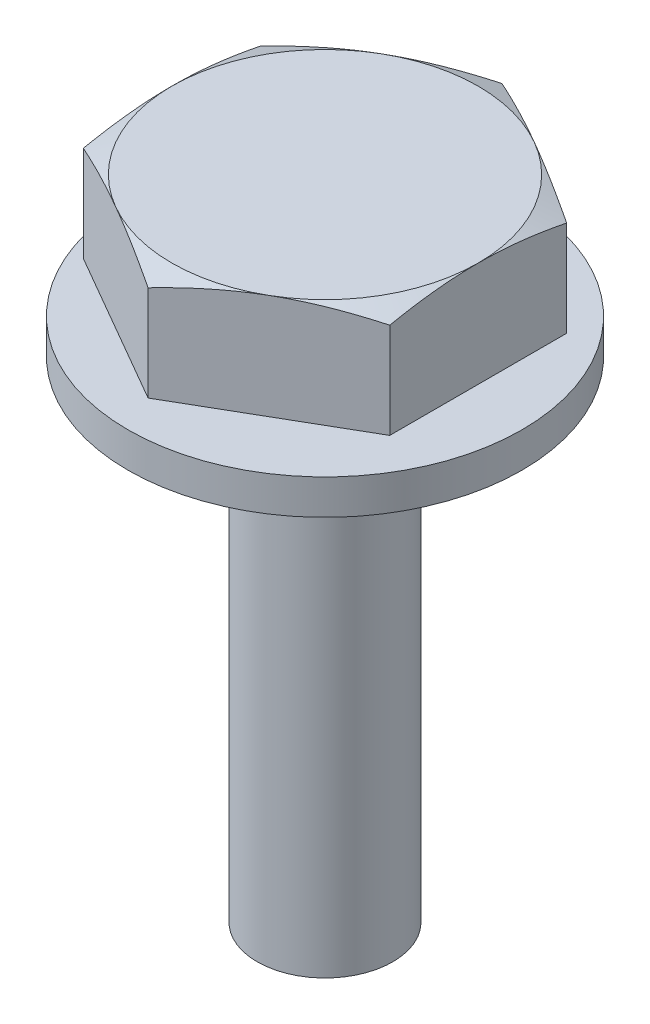
ISO-10303-21;
HEADER;
FILE_DESCRIPTION(('STEP AP214'),'2;1');
FILE_NAME('part.step','',(''),(''),'','','');
FILE_SCHEMA(('AUTOMOTIVE_DESIGN { 1 0 10303 214 1 1 1 1 }'));
ENDSEC;
DATA;
#1=APPLICATION_CONTEXT('core data for automotive mechanical design processes');
#2=APPLICATION_PROTOCOL_DEFINITION('international standard','automotive_design',2000,#1);
#3=PRODUCT_CONTEXT('',#1,'mechanical');
#4=PRODUCT('Part','Part','',(#3));
#5=PRODUCT_RELATED_PRODUCT_CATEGORY('part','',(#4));
#6=PRODUCT_DEFINITION_FORMATION('','',#4);
#7=PRODUCT_DEFINITION_CONTEXT('part definition',#1,'design');
#8=PRODUCT_DEFINITION('design','',#6,#7);
#9=PRODUCT_DEFINITION_SHAPE('','',#8);
#10=(LENGTH_UNIT() NAMED_UNIT(*) SI_UNIT(.MILLI.,.METRE.));
#11=(NAMED_UNIT(*) PLANE_ANGLE_UNIT() SI_UNIT($,.RADIAN.));
#12=(NAMED_UNIT(*) SI_UNIT($,.STERADIAN.) SOLID_ANGLE_UNIT());
#13=UNCERTAINTY_MEASURE_WITH_UNIT(LENGTH_MEASURE(1.E-05),#10,'distance_accuracy_value','');
#14=(GEOMETRIC_REPRESENTATION_CONTEXT(3) GLOBAL_UNCERTAINTY_ASSIGNED_CONTEXT((#13)) GLOBAL_UNIT_ASSIGNED_CONTEXT((#10,
#11,#12)) REPRESENTATION_CONTEXT('',''));
#15=CARTESIAN_POINT('',(0.,0.,0.));
#16=DIRECTION('',(0.,0.,1.));
#17=DIRECTION('',(1.,0.,0.));
#18=AXIS2_PLACEMENT_3D('',#15,#16,#17);
#19=CARTESIAN_POINT('',(3.5,3.6,2.02072594216369));
#20=DIRECTION('',(-1.,0.,0.));
#21=DIRECTION('',(0.,0.,1.));
#22=AXIS2_PLACEMENT_3D('',#19,#20,#21);
#23=PLANE('',#22);
#24=DIRECTION('',(0.,-1.,0.));
#25=VECTOR('',#24,1.);
#26=CARTESIAN_POINT('',(3.5,3.6,2.02072594216369));
#27=LINE('',#26,#25);
#28=CARTESIAN_POINT('',(3.5,3.38123923870388,2.02072594216369));
#29=VERTEX_POINT('',#28);
#30=CARTESIAN_POINT('',(3.5,1.2,2.02072594216369));
#31=VERTEX_POINT('',#30);
#32=EDGE_CURVE('E475',#29,#31,#27,.T.);
#33=ORIENTED_EDGE('',*,*,#32,.T.);
#34=DIRECTION('',(0.,0.,-1.));
#35=VECTOR('',#34,1.);
#36=CARTESIAN_POINT('',(3.5,1.2,2.02072594216369));
#37=LINE('',#36,#35);
#38=CARTESIAN_POINT('',(3.5,1.2,-2.02072594216369));
#39=VERTEX_POINT('',#38);
#40=EDGE_CURVE('E62',#31,#39,#37,.T.);
#41=ORIENTED_EDGE('',*,*,#40,.T.);
#42=DIRECTION('',(0.,-1.,0.));
#43=VECTOR('',#42,1.);
#44=CARTESIAN_POINT('',(3.5,3.6,-2.02072594216369));
#45=LINE('',#44,#43);
#46=CARTESIAN_POINT('',(3.5,3.38123923870388,-2.02072594216369));
#47=VERTEX_POINT('',#46);
#48=EDGE_CURVE('E136',#47,#39,#45,.T.);
#49=ORIENTED_EDGE('',*,*,#48,.F.);
#50=CARTESIAN_POINT('',(3.5,2.4300508343239,-5.35306533657691));
#51=CARTESIAN_POINT('',(3.5,2.48346155765736,-5.1950753679763));
#52=CARTESIAN_POINT('',(3.5,2.53626398738455,-5.03687591015874));
#53=CARTESIAN_POINT('',(3.5,2.64031244761823,-4.71994959738972));
#54=CARTESIAN_POINT('',(3.5,2.69155832654002,-4.56122269273208));
#55=CARTESIAN_POINT('',(3.5,2.79226378420092,-4.24278294314116));
#56=CARTESIAN_POINT('',(3.5,2.84171879225537,-4.08306864750374));
#57=CARTESIAN_POINT('',(3.5,2.93823806785051,-3.76292072410802));
#58=CARTESIAN_POINT('',(3.5,2.98530239304236,-3.60248711379758));
#59=CARTESIAN_POINT('',(3.5,3.07585653850939,-3.28282129347723));
#60=CARTESIAN_POINT('',(3.5,3.11938431933132,-3.12359989057927));
#61=CARTESIAN_POINT('',(3.5,3.20277894009919,-2.8042017355444));
#62=CARTESIAN_POINT('',(3.5,3.24264593765861,-2.64402502485437));
#63=CARTESIAN_POINT('',(3.5,3.31777571595882,-2.32267350215786));
#64=CARTESIAN_POINT('',(3.5,3.35304085959137,-2.16149924724112));
#65=CARTESIAN_POINT('',(3.5,3.41787861054941,-1.83800455878839));
#66=CARTESIAN_POINT('',(3.5,3.44745162407206,-1.67568420789678));
#67=CARTESIAN_POINT('',(3.5,3.49433334187003,-1.38321393340718));
#68=CARTESIAN_POINT('',(3.5,3.51291332330933,-1.25326883561415));
#69=CARTESIAN_POINT('',(3.5,3.54506839695318,-0.99276403552018));
#70=CARTESIAN_POINT('',(3.5,3.55864392207346,-0.862204387371606));
#71=CARTESIAN_POINT('',(3.5,3.58025492794144,-0.600703634368214));
#72=CARTESIAN_POINT('',(3.5,3.58829386753105,-0.469762819083182));
#73=CARTESIAN_POINT('',(3.5,3.59849392704442,-0.207650173182865));
#74=CARTESIAN_POINT('',(3.5,3.60065509548065,-0.0764783444832006));
#75=CARTESIAN_POINT('',(3.5,3.59899586306662,0.186459537426483));
#76=CARTESIAN_POINT('',(3.5,3.59514657513968,0.318225406725226));
#77=CARTESIAN_POINT('',(3.5,3.58159000589472,0.581452921171216));
#78=CARTESIAN_POINT('',(3.5,3.57188262808748,0.712914561271669));
#79=CARTESIAN_POINT('',(3.5,3.54702010765556,0.9754007152223));
#80=CARTESIAN_POINT('',(3.5,3.53186148067023,1.10642489526813));
#81=CARTESIAN_POINT('',(3.5,3.49666707640026,1.36780529956763));
#82=CARTESIAN_POINT('',(3.5,3.47663131369217,1.49816152581645));
#83=CARTESIAN_POINT('',(3.5,3.4026879429025,1.93215419858271));
#84=CARTESIAN_POINT('',(3.5,3.33933737111546,2.23419312375299));
#85=CARTESIAN_POINT('',(3.5,3.23264313152986,2.68441755849721));
#86=CARTESIAN_POINT('',(3.5,3.19511869550151,2.834071177592));
#87=CARTESIAN_POINT('',(3.5,3.11689021594628,3.13254745234657));
#88=CARTESIAN_POINT('',(3.5,3.07618629249383,3.28137013915958));
#89=CARTESIAN_POINT('',(3.5,2.95003343787933,3.72753501404256));
#90=CARTESIAN_POINT('',(3.5,2.86073791250425,4.02378339512394));
#91=CARTESIAN_POINT('',(3.5,2.67543860394259,4.61405877702836));
#92=CARTESIAN_POINT('',(3.5,2.57943656297531,4.90808633294596));
#93=CARTESIAN_POINT('',(3.5,2.38347742785359,5.49267919586328));
#94=CARTESIAN_POINT('',(3.5,2.28355024566531,5.78325457433879));
#95=CARTESIAN_POINT('',(3.5,2.08049529803781,6.36330504097756));
#96=CARTESIAN_POINT('',(3.5,1.97736728700595,6.65278004278904));
#97=CARTESIAN_POINT('',(3.5,1.76950360350122,7.22896400727524));
#98=CARTESIAN_POINT('',(3.5,1.66478328584974,7.51567852491708));
#99=CARTESIAN_POINT('',(3.5,1.45362677111334,8.0884334329212));
#100=CARTESIAN_POINT('',(3.5,1.3471907981219,8.37447390581973));
#101=CARTESIAN_POINT('',(3.5,1.24016239653399,8.66028874910715));
#102=B_SPLINE_CURVE_WITH_KNOTS('',3,(#50,#51,#52,#53,#54,#55,#56,#57,#58,#59,#60,#61,#62,#63,
#64,#65,#66,#67,#68,#69,#70,#71,#72,#73,#74,#75,#76,#77,#78,#79,#80,#81,#82,#83,#84,#85,#86,#87,
#88,#89,#90,#91,#92,#93,#94,#95,#96,#97,#98,#99,#100,#101),.UNSPECIFIED.,.F.,.F.,(4,2,2,2,2,2,2,
2,2,2,2,2,2,2,2,2,2,2,2,2,2,2,2,2,2,4),(0.,0.500325937408458,1.00070044384664,1.50227298964601,
2.00383343430858,2.49899126997201,2.9941277768189,3.48900903946754,3.98385497369813,
4.37757147120153,4.77125390185054,5.16469016571312,5.55812318232149,5.95345291991733,
6.34878916920928,6.74437856224614,7.13996677298033,8.06502547305402,8.52787424943281,
8.99070555461105,9.9188091129075,10.8466724585747,11.768478307447,12.6903550601774,
13.6060694082989,14.521665102636),.UNSPECIFIED.);
#103=CARTESIAN_POINT('',(3.5,3.6,0.));
#104=VERTEX_POINT('',#103);
#105=EDGE_CURVE('E182',#47,#104,#102,.T.);
#106=ORIENTED_EDGE('',*,*,#105,.T.);
#107=EDGE_CURVE('E183',#104,#29,#102,.T.);
#108=ORIENTED_EDGE('',*,*,#107,.T.);
#109=EDGE_LOOP('',(#33,#41,#49,#106,#108));
#110=FACE_BOUND('',#109,.T.);
#111=ADVANCED_FACE('F44',(#110),#23,.F.);
#112=CARTESIAN_POINT('',(3.5,3.6,-2.02072594216369));
#113=DIRECTION('',(-0.5,0.,0.866025403784439));
#114=DIRECTION('',(0.866025403784439,0.,0.5));
#115=AXIS2_PLACEMENT_3D('',#112,#113,#114);
#116=PLANE('',#115);
#117=ORIENTED_EDGE('',*,*,#48,.T.);
#118=DIRECTION('',(-0.866025403784439,0.,-0.5));
#119=VECTOR('',#118,1.);
#120=CARTESIAN_POINT('',(3.5,1.2,-2.02072594216369));
#121=LINE('',#120,#119);
#122=CARTESIAN_POINT('',(0.,1.2,-4.04145188432738));
#123=VERTEX_POINT('',#122);
#124=EDGE_CURVE('E120',#39,#123,#121,.T.);
#125=ORIENTED_EDGE('',*,*,#124,.T.);
#126=DIRECTION('',(0.,-1.,0.));
#127=VECTOR('',#126,1.);
#128=CARTESIAN_POINT('',(0.,3.6,-4.04145188432738));
#129=LINE('',#128,#127);
#130=CARTESIAN_POINT('',(0.,3.38123923870388,-4.04145188432738));
#131=VERTEX_POINT('',#130);
#132=EDGE_CURVE('E133',#131,#123,#129,.T.);
#133=ORIENTED_EDGE('',*,*,#132,.F.);
#134=CARTESIAN_POINT('',(-0.000200000000000297,3.38119258377448,-4.04156735438122));
#135=CARTESIAN_POINT('',(0.122085929135992,3.40972164334923,-3.97096554027645));
#136=CARTESIAN_POINT('',(0.244775487889238,3.43610165272524,-3.90013069050351));
#137=CARTESIAN_POINT('',(0.490965949167626,3.483752768212,-3.75799256141251));
#138=CARTESIAN_POINT('',(0.614467283861517,3.50502088027974,-3.68668903258172));
#139=CARTESIAN_POINT('',(0.862105575806666,3.54159670249352,-3.54371499806552));
#140=CARTESIAN_POINT('',(0.986242333562133,3.55690617950925,-3.47204460755908));
#141=CARTESIAN_POINT('',(1.23497707911009,3.58085522824735,-3.32843753526015));
#142=CARTESIAN_POINT('',(1.35957495918938,3.58949626963482,-3.25650091565592));
#143=CARTESIAN_POINT('',(1.6068737232644,3.59957103933277,-3.11372290764694));
#144=CARTESIAN_POINT('',(1.72957088823022,3.60112467394082,-3.04288366642512));
#145=CARTESIAN_POINT('',(1.97489280012063,3.59726716634426,-2.90124699455708));
#146=CARTESIAN_POINT('',(2.09751753973065,3.59185541184882,-2.83044956813393));
#147=CARTESIAN_POINT('',(2.34231704259534,3.57435859327198,-2.68911450925751));
#148=CARTESIAN_POINT('',(2.4644920589451,3.5622781600176,-2.61857673067973));
#149=CARTESIAN_POINT('',(2.70827303515643,3.53202794355208,-2.47782971844081));
#150=CARTESIAN_POINT('',(2.82987898487684,3.51385805223828,-2.40762049063467));
#151=CARTESIAN_POINT('',(2.99701679252287,3.48513297701375,-2.31112343239848));
#152=CARTESIAN_POINT('',(3.04285313459036,3.47686434845785,-2.28465980796714));
#153=CARTESIAN_POINT('',(3.13441758547267,3.4596066960026,-2.23179504760204));
#154=CARTESIAN_POINT('',(3.18014570953026,3.45061778064793,-2.20539390286785));
#155=CARTESIAN_POINT('',(3.27165413928666,3.43192916305016,-2.15256148631487));
#156=CARTESIAN_POINT('',(3.3174340865281,3.42222712991857,-2.12613042145154));
#157=CARTESIAN_POINT('',(3.40889362452158,3.40218080448995,-2.07332623257105));
#158=CARTESIAN_POINT('',(3.45457320382702,3.39183644251187,-2.04695311516258));
#159=CARTESIAN_POINT('',(3.5002,3.38119258377448,-2.02061047210985));
#160=B_SPLINE_CURVE_WITH_KNOTS('',3,(#134,#135,#136,#137,#138,#139,#140,#141,#142,#143,#144,
#145,#146,#147,#148,#149,#150,#151,#152,#153,#154,#155,#156,#157,#158,#159),.UNSPECIFIED.,.F.,
.F.,(4,2,2,2,2,2,2,2,2,2,2,2,4),(0.,0.43220076307735,0.864654053032754,1.29697901296148,
1.72920866500471,2.15409796288952,2.57902461311523,3.00365655864066,3.42829604281256,
3.5890007326236,3.74968125018498,3.91091256606589,4.07216140328838),.UNSPECIFIED.);
#161=CARTESIAN_POINT('',(1.75,3.6,-3.03108891324554));
#162=VERTEX_POINT('',#161);
#163=EDGE_CURVE('E237',#131,#162,#160,.T.);
#164=ORIENTED_EDGE('',*,*,#163,.T.);
#165=EDGE_CURVE('E232',#162,#47,#160,.T.);
#166=ORIENTED_EDGE('',*,*,#165,.T.);
#167=EDGE_LOOP('',(#117,#125,#133,#164,#166));
#168=FACE_BOUND('',#167,.T.);
#169=ADVANCED_FACE('F131',(#168),#116,.F.);
#170=CARTESIAN_POINT('',(0.,3.6,-4.04145188432738));
#171=DIRECTION('',(0.5,0.,0.866025403784439));
#172=DIRECTION('',(0.866025403784439,0.,-0.5));
#173=AXIS2_PLACEMENT_3D('',#170,#171,#172);
#174=PLANE('',#173);
#175=ORIENTED_EDGE('',*,*,#132,.T.);
#176=DIRECTION('',(-0.866025403784439,0.,0.5));
#177=VECTOR('',#176,1.);
#178=CARTESIAN_POINT('',(0.,1.2,-4.04145188432738));
#179=LINE('',#178,#177);
#180=CARTESIAN_POINT('',(-3.5,1.2,-2.02072594216369));
#181=VERTEX_POINT('',#180);
#182=EDGE_CURVE('E117',#123,#181,#179,.T.);
#183=ORIENTED_EDGE('',*,*,#182,.T.);
#184=DIRECTION('',(0.,-1.,0.));
#185=VECTOR('',#184,1.);
#186=CARTESIAN_POINT('',(-3.5,3.6,-2.02072594216369));
#187=LINE('',#186,#185);
#188=CARTESIAN_POINT('',(-3.5,3.38123923870388,-2.02072594216369));
#189=VERTEX_POINT('',#188);
#190=EDGE_CURVE('E142',#189,#181,#187,.T.);
#191=ORIENTED_EDGE('',*,*,#190,.F.);
#192=CARTESIAN_POINT('',(-3.5002,3.38119258377448,-2.02061047210985));
#193=CARTESIAN_POINT('',(-3.37791407086401,3.40972164334923,-2.09121228621462));
#194=CARTESIAN_POINT('',(-3.25522451211076,3.43610165272524,-2.16204713598757));
#195=CARTESIAN_POINT('',(-3.00903405083237,3.483752768212,-2.30418526507856));
#196=CARTESIAN_POINT('',(-2.88553271613848,3.50502088027974,-2.37548879390936));
#197=CARTESIAN_POINT('',(-2.63789442419333,3.54159670249352,-2.51846282842555));
#198=CARTESIAN_POINT('',(-2.51375766643787,3.55690617950925,-2.59013321893199));
#199=CARTESIAN_POINT('',(-2.26502292088991,3.58085522824735,-2.73374029123092));
#200=CARTESIAN_POINT('',(-2.14042504081062,3.58949626963482,-2.80567691083515));
#201=CARTESIAN_POINT('',(-1.8931262767356,3.59957103933277,-2.94845491884413));
#202=CARTESIAN_POINT('',(-1.77042911176978,3.60112467394082,-3.01929416006595));
#203=CARTESIAN_POINT('',(-1.52510719987937,3.59726716634426,-3.16093083193399));
#204=CARTESIAN_POINT('',(-1.40248246026935,3.59185541184882,-3.23172825835714));
#205=CARTESIAN_POINT('',(-1.15768295740466,3.57435859327198,-3.37306331723356));
#206=CARTESIAN_POINT('',(-1.0355079410549,3.5622781600176,-3.44360109581134));
#207=CARTESIAN_POINT('',(-0.791726964843564,3.53202794355208,-3.58434810805026));
#208=CARTESIAN_POINT('',(-0.67012101512316,3.51385805223828,-3.6545573358564));
#209=CARTESIAN_POINT('',(-0.502983207477132,3.48513297701375,-3.7510543940926));
#210=CARTESIAN_POINT('',(-0.457146865409637,3.47686434845785,-3.77751801852393));
#211=CARTESIAN_POINT('',(-0.365582414527334,3.4596066960026,-3.83038277888903));
#212=CARTESIAN_POINT('',(-0.319854290469738,3.45061778064793,-3.85678392362322));
#213=CARTESIAN_POINT('',(-0.228345860713339,3.43192916305016,-3.9096163401762));
#214=CARTESIAN_POINT('',(-0.182565913471896,3.42222712991857,-3.93604740503953));
#215=CARTESIAN_POINT('',(-0.0911063754784197,3.40218080448995,-3.98885159392002));
#216=CARTESIAN_POINT('',(-0.0454267961729788,3.39183644251187,-4.01522471132849));
#217=CARTESIAN_POINT('',(0.000199999999999747,3.38119258377448,-4.04156735438122));
#218=B_SPLINE_CURVE_WITH_KNOTS('',3,(#192,#193,#194,#195,#196,#197,#198,#199,#200,#201,#202,
#203,#204,#205,#206,#207,#208,#209,#210,#211,#212,#213,#214,#215,#216,#217),.UNSPECIFIED.,.F.,
.F.,(4,2,2,2,2,2,2,2,2,2,2,2,4),(0.,0.43220076307735,0.864654053032754,1.29697901296148,
1.72920866500471,2.15409796288952,2.57902461311523,3.00365655864066,3.42829604281256,
3.5890007326236,3.74968125018498,3.91091256606589,4.07216140328837),.UNSPECIFIED.);
#219=CARTESIAN_POINT('',(-1.75,3.6,-3.03108891324554));
#220=VERTEX_POINT('',#219);
#221=EDGE_CURVE('E478',#189,#220,#218,.T.);
#222=ORIENTED_EDGE('',*,*,#221,.T.);
#223=EDGE_CURVE('E141',#220,#131,#218,.T.);
#224=ORIENTED_EDGE('',*,*,#223,.T.);
#225=EDGE_LOOP('',(#175,#183,#191,#222,#224));
#226=FACE_BOUND('',#225,.T.);
#227=ADVANCED_FACE('F139',(#226),#174,.F.);
#228=CARTESIAN_POINT('',(-3.5,3.6,-2.02072594216369));
#229=DIRECTION('',(1.,0.,0.));
#230=DIRECTION('',(0.,0.,-1.));
#231=AXIS2_PLACEMENT_3D('',#228,#229,#230);
#232=PLANE('',#231);
#233=ORIENTED_EDGE('',*,*,#190,.T.);
#234=DIRECTION('',(0.,0.,1.));
#235=VECTOR('',#234,1.);
#236=CARTESIAN_POINT('',(-3.5,1.2,-2.02072594216369));
#237=LINE('',#236,#235);
#238=CARTESIAN_POINT('',(-3.5,1.2,2.02072594216369));
#239=VERTEX_POINT('',#238);
#240=EDGE_CURVE('E122',#181,#239,#237,.T.);
#241=ORIENTED_EDGE('',*,*,#240,.T.);
#242=DIRECTION('',(0.,-1.,0.));
#243=VECTOR('',#242,1.);
#244=CARTESIAN_POINT('',(-3.5,3.6,2.02072594216369));
#245=LINE('',#244,#243);
#246=CARTESIAN_POINT('',(-3.5,3.38123923870388,2.02072594216369));
#247=VERTEX_POINT('',#246);
#248=EDGE_CURVE('E146',#247,#239,#245,.T.);
#249=ORIENTED_EDGE('',*,*,#248,.F.);
#250=CARTESIAN_POINT('',(-3.5,2.4300508343239,-5.35306533657691));
#251=CARTESIAN_POINT('',(-3.5,2.48346155765736,-5.1950753679763));
#252=CARTESIAN_POINT('',(-3.5,2.53626398738455,-5.03687591015874));
#253=CARTESIAN_POINT('',(-3.5,2.64031244761823,-4.71994959738972));
#254=CARTESIAN_POINT('',(-3.5,2.69155832654002,-4.56122269273208));
#255=CARTESIAN_POINT('',(-3.5,2.79226378420092,-4.24278294314116));
#256=CARTESIAN_POINT('',(-3.5,2.84171879225537,-4.08306864750374));
#257=CARTESIAN_POINT('',(-3.5,2.93823806785051,-3.76292072410802));
#258=CARTESIAN_POINT('',(-3.5,2.98530239304236,-3.60248711379758));
#259=CARTESIAN_POINT('',(-3.5,3.07585653850939,-3.28282129347723));
#260=CARTESIAN_POINT('',(-3.5,3.11938431933132,-3.12359989057927));
#261=CARTESIAN_POINT('',(-3.5,3.20277894009919,-2.8042017355444));
#262=CARTESIAN_POINT('',(-3.5,3.24264593765861,-2.64402502485437));
#263=CARTESIAN_POINT('',(-3.5,3.31777571595882,-2.32267350215786));
#264=CARTESIAN_POINT('',(-3.5,3.35304085959137,-2.16149924724112));
#265=CARTESIAN_POINT('',(-3.5,3.41787861054941,-1.83800455878839));
#266=CARTESIAN_POINT('',(-3.5,3.44745162407206,-1.67568420789678));
#267=CARTESIAN_POINT('',(-3.5,3.49433334187003,-1.38321393340719));
#268=CARTESIAN_POINT('',(-3.5,3.51291332330933,-1.25326883561415));
#269=CARTESIAN_POINT('',(-3.5,3.54506839695318,-0.992764035520182));
#270=CARTESIAN_POINT('',(-3.5,3.55864392207346,-0.862204387371608));
#271=CARTESIAN_POINT('',(-3.5,3.58025492794144,-0.600703634368216));
#272=CARTESIAN_POINT('',(-3.5,3.58829386753105,-0.469762819083184));
#273=CARTESIAN_POINT('',(-3.5,3.59849392704442,-0.207650173182867));
#274=CARTESIAN_POINT('',(-3.5,3.60065509548065,-0.0764783444832025));
#275=CARTESIAN_POINT('',(-3.5,3.59899586306662,0.186459537426481));
#276=CARTESIAN_POINT('',(-3.5,3.59514657513968,0.318225406725224));
#277=CARTESIAN_POINT('',(-3.5,3.58159000589472,0.581452921171214));
#278=CARTESIAN_POINT('',(-3.5,3.57188262808748,0.712914561271667));
#279=CARTESIAN_POINT('',(-3.5,3.54702010765556,0.975400715222298));
#280=CARTESIAN_POINT('',(-3.5,3.53186148067023,1.10642489526813));
#281=CARTESIAN_POINT('',(-3.5,3.49666707640026,1.36780529956762));
#282=CARTESIAN_POINT('',(-3.5,3.47663131369217,1.49816152581645));
#283=CARTESIAN_POINT('',(-3.5,3.4026879429025,1.93215419858271));
#284=CARTESIAN_POINT('',(-3.5,3.33933737111546,2.23419312375299));
#285=CARTESIAN_POINT('',(-3.5,3.23264313152986,2.68441755849721));
#286=CARTESIAN_POINT('',(-3.5,3.19511869550152,2.834071177592));
#287=CARTESIAN_POINT('',(-3.5,3.11689021594628,3.13254745234656));
#288=CARTESIAN_POINT('',(-3.5,3.07618629249383,3.28137013915957));
#289=CARTESIAN_POINT('',(-3.5,2.95003343787934,3.72753501404256));
#290=CARTESIAN_POINT('',(-3.5,2.86073791250425,4.02378339512394));
#291=CARTESIAN_POINT('',(-3.5,2.67543860394259,4.61405877702836));
#292=CARTESIAN_POINT('',(-3.5,2.57943656297531,4.90808633294596));
#293=CARTESIAN_POINT('',(-3.5,2.38347742785359,5.49267919586328));
#294=CARTESIAN_POINT('',(-3.5,2.28355024566531,5.78325457433879));
#295=CARTESIAN_POINT('',(-3.5,2.08049529803781,6.36330504097756));
#296=CARTESIAN_POINT('',(-3.5,1.97736728700595,6.65278004278904));
#297=CARTESIAN_POINT('',(-3.5,1.76950360350122,7.22896400727523));
#298=CARTESIAN_POINT('',(-3.5,1.66478328584974,7.51567852491708));
#299=CARTESIAN_POINT('',(-3.5,1.45362677111334,8.0884334329212));
#300=CARTESIAN_POINT('',(-3.5,1.3471907981219,8.37447390581973));
#301=CARTESIAN_POINT('',(-3.5,1.24016239653399,8.66028874910714));
#302=B_SPLINE_CURVE_WITH_KNOTS('',3,(#250,#251,#252,#253,#254,#255,#256,#257,#258,#259,#260,
#261,#262,#263,#264,#265,#266,#267,#268,#269,#270,#271,#272,#273,#274,#275,#276,#277,#278,#279,
#280,#281,#282,#283,#284,#285,#286,#287,#288,#289,#290,#291,#292,#293,#294,#295,#296,#297,#298,
#299,#300,#301),.UNSPECIFIED.,.F.,.F.,(4,2,2,2,2,2,2,2,2,2,2,2,2,2,2,2,2,2,2,2,2,2,2,2,2,4),(0.,
0.500325937408458,1.00070044384664,1.50227298964601,2.00383343430858,2.49899126997201,
2.9941277768189,3.48900903946754,3.98385497369813,4.37757147120153,4.77125390185053,
5.16469016571312,5.55812318232149,5.95345291991732,6.34878916920928,6.74437856224614,
7.13996677298033,8.06502547305401,8.5278742494328,8.99070555461105,9.9188091129075,
10.8466724585747,11.768478307447,12.6903550601774,13.6060694082989,14.521665102636),.UNSPECIFIED.);
#303=CARTESIAN_POINT('',(-3.5,3.6,0.));
#304=VERTEX_POINT('',#303);
#305=EDGE_CURVE('E188',#247,#304,#302,.F.);
#306=ORIENTED_EDGE('',*,*,#305,.T.);
#307=EDGE_CURVE('E480',#304,#189,#302,.F.);
#308=ORIENTED_EDGE('',*,*,#307,.T.);
#309=EDGE_LOOP('',(#233,#241,#249,#306,#308));
#310=FACE_BOUND('',#309,.T.);
#311=ADVANCED_FACE('F248',(#310),#232,.F.);
#312=CARTESIAN_POINT('',(-3.5,3.6,2.02072594216369));
#313=DIRECTION('',(0.5,0.,-0.866025403784439));
#314=DIRECTION('',(-0.866025403784439,0.,-0.5));
#315=AXIS2_PLACEMENT_3D('',#312,#313,#314);
#316=PLANE('',#315);
#317=ORIENTED_EDGE('',*,*,#248,.T.);
#318=DIRECTION('',(0.866025403784439,0.,0.5));
#319=VECTOR('',#318,1.);
#320=CARTESIAN_POINT('',(-3.5,1.2,2.02072594216369));
#321=LINE('',#320,#319);
#322=CARTESIAN_POINT('',(0.,1.2,4.04145188432738));
#323=VERTEX_POINT('',#322);
#324=EDGE_CURVE('E462',#239,#323,#321,.T.);
#325=ORIENTED_EDGE('',*,*,#324,.T.);
#326=DIRECTION('',(0.,-1.,0.));
#327=VECTOR('',#326,1.);
#328=CARTESIAN_POINT('',(0.,3.6,4.04145188432738));
#329=LINE('',#328,#327);
#330=CARTESIAN_POINT('',(0.,3.38123923870388,4.04145188432738));
#331=VERTEX_POINT('',#330);
#332=EDGE_CURVE('E473',#331,#323,#329,.T.);
#333=ORIENTED_EDGE('',*,*,#332,.F.);
#334=CARTESIAN_POINT('',(0.000199999999999869,3.38119258377448,4.04156735438122));
#335=CARTESIAN_POINT('',(-0.122085929135993,3.40972164334923,3.97096554027645));
#336=CARTESIAN_POINT('',(-0.244775487889238,3.43610165272524,3.90013069050351));
#337=CARTESIAN_POINT('',(-0.490965949167626,3.483752768212,3.75799256141251));
#338=CARTESIAN_POINT('',(-0.614467283861517,3.50502088027974,3.68668903258172));
#339=CARTESIAN_POINT('',(-0.862105575806667,3.54159670249352,3.54371499806552));
#340=CARTESIAN_POINT('',(-0.986242333562134,3.55690617950925,3.47204460755908));
#341=CARTESIAN_POINT('',(-1.23497707911009,3.58085522824735,3.32843753526015));
#342=CARTESIAN_POINT('',(-1.35957495918938,3.58949626963482,3.25650091565592));
#343=CARTESIAN_POINT('',(-1.6068737232644,3.59957103933277,3.11372290764694));
#344=CARTESIAN_POINT('',(-1.72957088823022,3.60112467394082,3.04288366642512));
#345=CARTESIAN_POINT('',(-1.97489280012063,3.59726716634426,2.90124699455708));
#346=CARTESIAN_POINT('',(-2.09751753973065,3.59185541184882,2.83044956813393));
#347=CARTESIAN_POINT('',(-2.34231704259534,3.57435859327198,2.68911450925751));
#348=CARTESIAN_POINT('',(-2.4644920589451,3.5622781600176,2.61857673067973));
#349=CARTESIAN_POINT('',(-2.70827303515644,3.53202794355208,2.47782971844081));
#350=CARTESIAN_POINT('',(-2.82987898487684,3.51385805223828,2.40762049063467));
#351=CARTESIAN_POINT('',(-2.99701679252287,3.48513297701375,2.31112343239847));
#352=CARTESIAN_POINT('',(-3.04285313459036,3.47686434845785,2.28465980796714));
#353=CARTESIAN_POINT('',(-3.13441758547267,3.4596066960026,2.23179504760204));
#354=CARTESIAN_POINT('',(-3.18014570953026,3.45061778064793,2.20539390286785));
#355=CARTESIAN_POINT('',(-3.27165413928666,3.43192916305016,2.15256148631487));
#356=CARTESIAN_POINT('',(-3.3174340865281,3.42222712991857,2.12613042145154));
#357=CARTESIAN_POINT('',(-3.40889362452158,3.40218080448995,2.07332623257105));
#358=CARTESIAN_POINT('',(-3.45457320382702,3.39183644251187,2.04695311516258));
#359=CARTESIAN_POINT('',(-3.5002,3.38119258377448,2.02061047210985));
#360=B_SPLINE_CURVE_WITH_KNOTS('',3,(#334,#335,#336,#337,#338,#339,#340,#341,#342,#343,#344,
#345,#346,#347,#348,#349,#350,#351,#352,#353,#354,#355,#356,#357,#358,#359),.UNSPECIFIED.,.F.,
.F.,(4,2,2,2,2,2,2,2,2,2,2,2,4),(0.,0.43220076307735,0.864654053032754,1.29697901296148,
1.72920866500471,2.15409796288952,2.57902461311523,3.00365655864066,3.42829604281256,
3.5890007326236,3.74968125018498,3.91091256606589,4.07216140328838),.UNSPECIFIED.);
#361=CARTESIAN_POINT('',(-1.75,3.6,3.03108891324554));
#362=VERTEX_POINT('',#361);
#363=EDGE_CURVE('E190',#331,#362,#360,.T.);
#364=ORIENTED_EDGE('',*,*,#363,.T.);
#365=EDGE_CURVE('E185',#362,#247,#360,.T.);
#366=ORIENTED_EDGE('',*,*,#365,.T.);
#367=EDGE_LOOP('',(#317,#325,#333,#364,#366));
#368=FACE_BOUND('',#367,.T.);
#369=ADVANCED_FACE('F251',(#368),#316,.F.);
#370=CARTESIAN_POINT('',(0.,3.6,4.04145188432738));
#371=DIRECTION('',(-0.5,0.,-0.866025403784439));
#372=DIRECTION('',(-0.866025403784439,0.,0.5));
#373=AXIS2_PLACEMENT_3D('',#370,#371,#372);
#374=PLANE('',#373);
#375=ORIENTED_EDGE('',*,*,#332,.T.);
#376=DIRECTION('',(0.866025403784439,0.,-0.5));
#377=VECTOR('',#376,1.);
#378=CARTESIAN_POINT('',(0.,1.2,4.04145188432738));
#379=LINE('',#378,#377);
#380=EDGE_CURVE('E53',#323,#31,#379,.T.);
#381=ORIENTED_EDGE('',*,*,#380,.T.);
#382=ORIENTED_EDGE('',*,*,#32,.F.);
#383=CARTESIAN_POINT('',(3.5002,3.38119258377447,2.02061047210985));
#384=CARTESIAN_POINT('',(3.37791407086401,3.40972164334923,2.09121228621462));
#385=CARTESIAN_POINT('',(3.25522451211076,3.43610165272524,2.16204713598756));
#386=CARTESIAN_POINT('',(3.00903405083237,3.483752768212,2.30418526507856));
#387=CARTESIAN_POINT('',(2.88553271613848,3.50502088027974,2.37548879390935));
#388=CARTESIAN_POINT('',(2.63789442419333,3.54159670249352,2.51846282842555));
#389=CARTESIAN_POINT('',(2.51375766643787,3.55690617950925,2.59013321893199));
#390=CARTESIAN_POINT('',(2.26502292088991,3.58085522824735,2.73374029123092));
#391=CARTESIAN_POINT('',(2.14042504081062,3.58949626963482,2.80567691083515));
#392=CARTESIAN_POINT('',(1.8931262767356,3.59957103933277,2.94845491884413));
#393=CARTESIAN_POINT('',(1.77042911176977,3.60112467394082,3.01929416006595));
#394=CARTESIAN_POINT('',(1.52510719987937,3.59726716634426,3.16093083193399));
#395=CARTESIAN_POINT('',(1.40248246026935,3.59185541184882,3.23172825835714));
#396=CARTESIAN_POINT('',(1.15768295740466,3.57435859327198,3.37306331723356));
#397=CARTESIAN_POINT('',(1.0355079410549,3.5622781600176,3.44360109581134));
#398=CARTESIAN_POINT('',(0.791726964843563,3.53202794355208,3.58434810805026));
#399=CARTESIAN_POINT('',(0.670121015123159,3.51385805223828,3.6545573358564));
#400=CARTESIAN_POINT('',(0.502983207477131,3.48513297701375,3.7510543940926));
#401=CARTESIAN_POINT('',(0.457146865409637,3.47686434845785,3.77751801852393));
#402=CARTESIAN_POINT('',(0.365582414527333,3.4596066960026,3.83038277888903));
#403=CARTESIAN_POINT('',(0.319854290469738,3.45061778064793,3.85678392362322));
#404=CARTESIAN_POINT('',(0.228345860713339,3.43192916305016,3.9096163401762));
#405=CARTESIAN_POINT('',(0.182565913471896,3.42222712991857,3.93604740503953));
#406=CARTESIAN_POINT('',(0.0911063754784194,3.40218080448995,3.98885159392002));
#407=CARTESIAN_POINT('',(0.0454267961729785,3.39183644251187,4.01522471132849));
#408=CARTESIAN_POINT('',(-0.000199999999999988,3.38119258377448,4.04156735438122));
#409=B_SPLINE_CURVE_WITH_KNOTS('',3,(#383,#384,#385,#386,#387,#388,#389,#390,#391,#392,#393,
#394,#395,#396,#397,#398,#399,#400,#401,#402,#403,#404,#405,#406,#407,#408),.UNSPECIFIED.,.F.,
.F.,(4,2,2,2,2,2,2,2,2,2,2,2,4),(0.,0.43220076307735,0.864654053032755,1.29697901296148,
1.72920866500471,2.15409796288952,2.57902461311524,3.00365655864066,3.42829604281256,
3.5890007326236,3.74968125018499,3.91091256606589,4.07216140328838),.UNSPECIFIED.);
#410=CARTESIAN_POINT('',(1.75,3.6,3.03108891324554));
#411=VERTEX_POINT('',#410);
#412=EDGE_CURVE('E469',#29,#411,#409,.T.);
#413=ORIENTED_EDGE('',*,*,#412,.T.);
#414=EDGE_CURVE('E221',#411,#331,#409,.T.);
#415=ORIENTED_EDGE('',*,*,#414,.T.);
#416=EDGE_LOOP('',(#375,#381,#382,#413,#415));
#417=FACE_BOUND('',#416,.T.);
#418=ADVANCED_FACE('F255',(#417),#374,.F.);
#419=CARTESIAN_POINT('',(0.,3.6,0.));
#420=DIRECTION('',(0.,-1.,0.));
#421=DIRECTION('',(0.,0.,-1.));
#422=AXIS2_PLACEMENT_3D('',#419,#420,#421);
#423=CONICAL_SURFACE('',#422,3.5,1.18682389135615);
#424=CARTESIAN_POINT('',(0.,3.6,0.));
#425=DIRECTION('',(0.,-1.,0.));
#426=DIRECTION('',(0.,0.,-1.));
#427=AXIS2_PLACEMENT_3D('',#424,#425,#426);
#428=CIRCLE('',#427,3.5);
#429=EDGE_CURVE('E144',#162,#220,#428,.F.);
#430=ORIENTED_EDGE('',*,*,#429,.F.);
#431=ORIENTED_EDGE('',*,*,#163,.F.);
#432=ORIENTED_EDGE('',*,*,#223,.F.);
#433=EDGE_LOOP('',(#430,#431,#432));
#434=FACE_BOUND('',#433,.T.);
#435=ADVANCED_FACE('F215',(#434),#423,.T.);
#436=CARTESIAN_POINT('',(0.,3.6,0.));
#437=DIRECTION('',(0.,-1.,0.));
#438=DIRECTION('',(0.,0.,-1.));
#439=AXIS2_PLACEMENT_3D('',#436,#437,#438);
#440=CIRCLE('',#439,3.5);
#441=EDGE_CURVE('E178',#162,#104,#440,.T.);
#442=ORIENTED_EDGE('',*,*,#441,.T.);
#443=ORIENTED_EDGE('',*,*,#105,.F.);
#444=ORIENTED_EDGE('',*,*,#165,.F.);
#445=EDGE_LOOP('',(#442,#443,#444));
#446=FACE_BOUND('',#445,.T.);
#447=ADVANCED_FACE('F300',(#446),#423,.T.);
#448=EDGE_CURVE('E151',#411,#104,#428,.F.);
#449=ORIENTED_EDGE('',*,*,#448,.F.);
#450=ORIENTED_EDGE('',*,*,#412,.F.);
#451=ORIENTED_EDGE('',*,*,#107,.F.);
#452=EDGE_LOOP('',(#449,#450,#451));
#453=FACE_BOUND('',#452,.T.);
#454=ADVANCED_FACE('F307',(#453),#423,.T.);
#455=ORIENTED_EDGE('',*,*,#414,.F.);
#456=EDGE_CURVE('E163',#362,#411,#428,.F.);
#457=ORIENTED_EDGE('',*,*,#456,.F.);
#458=ORIENTED_EDGE('',*,*,#363,.F.);
#459=EDGE_LOOP('',(#455,#457,#458));
#460=FACE_BOUND('',#459,.T.);
#461=ADVANCED_FACE('F216',(#460),#423,.T.);
#462=ORIENTED_EDGE('',*,*,#365,.F.);
#463=EDGE_CURVE('E159',#304,#362,#428,.F.);
#464=ORIENTED_EDGE('',*,*,#463,.F.);
#465=ORIENTED_EDGE('',*,*,#305,.F.);
#466=EDGE_LOOP('',(#462,#464,#465));
#467=FACE_BOUND('',#466,.T.);
#468=ADVANCED_FACE('F214',(#467),#423,.T.);
#469=ORIENTED_EDGE('',*,*,#307,.F.);
#470=EDGE_CURVE('E70',#220,#304,#428,.F.);
#471=ORIENTED_EDGE('',*,*,#470,.F.);
#472=ORIENTED_EDGE('',*,*,#221,.F.);
#473=EDGE_LOOP('',(#469,#471,#472));
#474=FACE_BOUND('',#473,.T.);
#475=ADVANCED_FACE('F209',(#474),#423,.T.);
#476=CARTESIAN_POINT('',(3.5,3.6,2.02072594216369));
#477=DIRECTION('',(0.,-1.,0.));
#478=DIRECTION('',(0.,0.,-1.));
#479=AXIS2_PLACEMENT_3D('',#476,#477,#478);
#480=PLANE('',#479);
#481=ORIENTED_EDGE('',*,*,#429,.T.);
#482=ORIENTED_EDGE('',*,*,#470,.T.);
#483=ORIENTED_EDGE('',*,*,#463,.T.);
#484=ORIENTED_EDGE('',*,*,#456,.T.);
#485=ORIENTED_EDGE('',*,*,#448,.T.);
#486=ORIENTED_EDGE('',*,*,#441,.F.);
#487=EDGE_LOOP('',(#481,#482,#483,#484,#485,#486));
#488=FACE_BOUND('',#487,.T.);
#489=ADVANCED_FACE('F176',(#488),#480,.F.);
#490=CARTESIAN_POINT('',(0.,1.2,-4.04145188432738));
#491=DIRECTION('',(0.,1.,0.));
#492=DIRECTION('',(0.,0.,1.));
#493=AXIS2_PLACEMENT_3D('',#490,#491,#492);
#494=PLANE('',#493);
#495=CARTESIAN_POINT('',(0.,1.2,0.));
#496=DIRECTION('',(0.,-1.,0.));
#497=DIRECTION('',(0.,0.,-1.));
#498=AXIS2_PLACEMENT_3D('',#495,#496,#497);
#499=CIRCLE('',#498,2.95);
#500=CARTESIAN_POINT('',(0.,1.2,-2.95));
#501=VERTEX_POINT('',#500);
#502=EDGE_CURVE('E453',#501,#501,#499,.T.);
#503=ORIENTED_EDGE('',*,*,#502,.F.);
#504=EDGE_LOOP('',(#503));
#505=FACE_BOUND('',#504,.T.);
#506=ORIENTED_EDGE('',*,*,#380,.F.);
#507=ORIENTED_EDGE('',*,*,#324,.F.);
#508=ORIENTED_EDGE('',*,*,#240,.F.);
#509=ORIENTED_EDGE('',*,*,#182,.F.);
#510=ORIENTED_EDGE('',*,*,#124,.F.);
#511=ORIENTED_EDGE('',*,*,#40,.F.);
#512=EDGE_LOOP('',(#506,#507,#508,#509,#510,#511));
#513=FACE_BOUND('',#512,.T.);
#514=ADVANCED_FACE('F119',(#505,#513),#494,.F.);
#515=CARTESIAN_POINT('',(0.,0.,0.));
#516=DIRECTION('',(0.,-1.,0.));
#517=DIRECTION('',(0.,0.,-1.));
#518=AXIS2_PLACEMENT_3D('',#515,#516,#517);
#519=CYLINDRICAL_SURFACE('',#518,2.95);
#520=CARTESIAN_POINT('',(0.,0.8,0.));
#521=DIRECTION('',(0.,-1.,0.));
#522=DIRECTION('',(0.,0.,-1.));
#523=AXIS2_PLACEMENT_3D('',#520,#521,#522);
#524=CIRCLE('',#523,2.95);
#525=CARTESIAN_POINT('',(0.,0.8,-2.95));
#526=VERTEX_POINT('',#525);
#527=EDGE_CURVE('E447',#526,#526,#524,.T.);
#528=ORIENTED_EDGE('',*,*,#527,.F.);
#529=EDGE_LOOP('',(#528));
#530=FACE_BOUND('',#529,.T.);
#531=ORIENTED_EDGE('',*,*,#502,.T.);
#532=EDGE_LOOP('',(#531));
#533=FACE_BOUND('',#532,.T.);
#534=ADVANCED_FACE('F339',(#530,#533),#519,.T.);
#535=CARTESIAN_POINT('',(0.,0.,0.));
#536=DIRECTION('',(0.,-1.,0.));
#537=DIRECTION('',(0.,0.,-1.));
#538=AXIS2_PLACEMENT_3D('',#535,#536,#537);
#539=CYLINDRICAL_SURFACE('',#538,2.15);
#540=CARTESIAN_POINT('',(0.,0.,0.));
#541=DIRECTION('',(0.,-1.,0.));
#542=DIRECTION('',(0.,0.,-1.));
#543=AXIS2_PLACEMENT_3D('',#540,#541,#542);
#544=CIRCLE('',#543,2.15);
#545=CARTESIAN_POINT('',(0.,0.,-2.15));
#546=VERTEX_POINT('',#545);
#547=EDGE_CURVE('E455',#546,#546,#544,.T.);
#548=ORIENTED_EDGE('',*,*,#547,.T.);
#549=EDGE_LOOP('',(#548));
#550=FACE_BOUND('',#549,.T.);
#551=CARTESIAN_POINT('',(0.,0.8,0.));
#552=DIRECTION('',(0.,-1.,0.));
#553=DIRECTION('',(0.,0.,-1.));
#554=AXIS2_PLACEMENT_3D('',#551,#552,#553);
#555=CIRCLE('',#554,2.15);
#556=CARTESIAN_POINT('',(0.,0.8,-2.15));
#557=VERTEX_POINT('',#556);
#558=EDGE_CURVE('E12',#557,#557,#555,.F.);
#559=ORIENTED_EDGE('',*,*,#558,.T.);
#560=EDGE_LOOP('',(#559));
#561=FACE_BOUND('',#560,.T.);
#562=ADVANCED_FACE('F346',(#550,#561),#539,.F.);
#563=CARTESIAN_POINT('',(0.,0.,-2.15));
#564=DIRECTION('',(0.,-1.,0.));
#565=DIRECTION('',(0.,0.,-1.));
#566=AXIS2_PLACEMENT_3D('',#563,#564,#565);
#567=PLANE('',#566);
#568=CARTESIAN_POINT('',(0.,0.,0.));
#569=DIRECTION('',(0.,-1.,0.));
#570=DIRECTION('',(0.,0.,-1.));
#571=AXIS2_PLACEMENT_3D('',#568,#569,#570);
#572=CIRCLE('',#571,4.5);
#573=CARTESIAN_POINT('',(0.,0.,-4.5));
#574=VERTEX_POINT('',#573);
#575=EDGE_CURVE('E483',#574,#574,#572,.T.);
#576=ORIENTED_EDGE('',*,*,#575,.T.);
#577=EDGE_LOOP('',(#576));
#578=FACE_BOUND('',#577,.T.);
#579=ORIENTED_EDGE('',*,*,#547,.F.);
#580=EDGE_LOOP('',(#579));
#581=FACE_BOUND('',#580,.T.);
#582=ADVANCED_FACE('F354',(#578,#581),#567,.T.);
#583=CARTESIAN_POINT('',(0.,0.,0.));
#584=DIRECTION('',(0.,-1.,0.));
#585=DIRECTION('',(0.,0.,-1.));
#586=AXIS2_PLACEMENT_3D('',#583,#584,#585);
#587=CYLINDRICAL_SURFACE('',#586,4.5);
#588=CARTESIAN_POINT('',(0.,0.800000000000002,0.));
#589=DIRECTION('',(0.,-1.,0.));
#590=DIRECTION('',(0.,0.,-1.));
#591=AXIS2_PLACEMENT_3D('',#588,#589,#590);
#592=CIRCLE('',#591,4.5);
#593=CARTESIAN_POINT('',(0.,0.8,-4.5));
#594=VERTEX_POINT('',#593);
#595=EDGE_CURVE('E485',#594,#594,#592,.T.);
#596=ORIENTED_EDGE('',*,*,#595,.T.);
#597=EDGE_LOOP('',(#596));
#598=FACE_BOUND('',#597,.T.);
#599=ORIENTED_EDGE('',*,*,#575,.F.);
#600=EDGE_LOOP('',(#599));
#601=FACE_BOUND('',#600,.T.);
#602=ADVANCED_FACE('F364',(#598,#601),#587,.T.);
#603=CARTESIAN_POINT('',(0.,0.8,-2.15));
#604=DIRECTION('',(0.,1.,0.));
#605=DIRECTION('',(0.,0.,1.));
#606=AXIS2_PLACEMENT_3D('',#603,#604,#605);
#607=PLANE('',#606);
#608=ORIENTED_EDGE('',*,*,#527,.T.);
#609=EDGE_LOOP('',(#608));
#610=FACE_BOUND('',#609,.T.);
#611=ORIENTED_EDGE('',*,*,#595,.F.);
#612=EDGE_LOOP('',(#611));
#613=FACE_BOUND('',#612,.T.);
#614=ADVANCED_FACE('F372',(#610,#613),#607,.T.);
#615=CARTESIAN_POINT('',(1.55,-11.2,0.));
#616=DIRECTION('',(0.,1.,0.));
#617=DIRECTION('',(0.,0.,1.));
#618=AXIS2_PLACEMENT_3D('',#615,#616,#617);
#619=PLANE('',#618);
#620=CARTESIAN_POINT('',(0.,-11.2,0.));
#621=DIRECTION('',(0.,1.,0.));
#622=DIRECTION('',(0.,0.,1.));
#623=AXIS2_PLACEMENT_3D('',#620,#621,#622);
#624=CIRCLE('',#623,1.55);
#625=CARTESIAN_POINT('',(0.,-11.2,1.55));
#626=VERTEX_POINT('',#625);
#627=EDGE_CURVE('E444',#626,#626,#624,.T.);
#628=ORIENTED_EDGE('',*,*,#627,.F.);
#629=EDGE_LOOP('',(#628));
#630=FACE_BOUND('',#629,.T.);
#631=ADVANCED_FACE('F266',(#630),#619,.F.);
#632=CARTESIAN_POINT('',(0.,5.08688703843889,0.));
#633=DIRECTION('',(0.,1.,0.));
#634=DIRECTION('',(0.,0.,1.));
#635=AXIS2_PLACEMENT_3D('',#632,#633,#634);
#636=CYLINDRICAL_SURFACE('',#635,1.55);
#637=CARTESIAN_POINT('',(0.,0.8,0.));
#638=DIRECTION('',(0.,1.,0.));
#639=DIRECTION('',(0.,0.,1.));
#640=AXIS2_PLACEMENT_3D('',#637,#638,#639);
#641=CIRCLE('',#640,1.55);
#642=CARTESIAN_POINT('',(0.,0.8,1.55));
#643=VERTEX_POINT('',#642);
#644=EDGE_CURVE('E448',#643,#643,#641,.T.);
#645=ORIENTED_EDGE('',*,*,#644,.F.);
#646=EDGE_LOOP('',(#645));
#647=FACE_BOUND('',#646,.T.);
#648=ORIENTED_EDGE('',*,*,#627,.T.);
#649=EDGE_LOOP('',(#648));
#650=FACE_BOUND('',#649,.T.);
#651=ADVANCED_FACE('F261',(#647,#650),#636,.T.);
#652=CARTESIAN_POINT('',(3.5,0.8,2.02072594216369));
#653=DIRECTION('',(0.,-1.,0.));
#654=DIRECTION('',(0.,0.,-1.));
#655=AXIS2_PLACEMENT_3D('',#652,#653,#654);
#656=PLANE('',#655);
#657=ORIENTED_EDGE('',*,*,#644,.T.);
#658=EDGE_LOOP('',(#657));
#659=FACE_BOUND('',#658,.T.);
#660=ORIENTED_EDGE('',*,*,#558,.F.);
#661=EDGE_LOOP('',(#660));
#662=FACE_BOUND('',#661,.T.);
#663=ADVANCED_FACE('F259',(#659,#662),#656,.T.);
#664=CLOSED_SHELL('',(#111,#169,#227,#311,#369,#418,#435,#447,#454,#461,#468,#475,#489,#514,
#534,#562,#582,#602,#614,#631,#651,#663));
#665=MANIFOLD_SOLID_BREP('B2',#664);
#666=ADVANCED_BREP_SHAPE_REPRESENTATION('',(#18,#665),#14);
#667=SHAPE_DEFINITION_REPRESENTATION(#9,#666);
ENDSEC;
END-ISO-10303-21;
